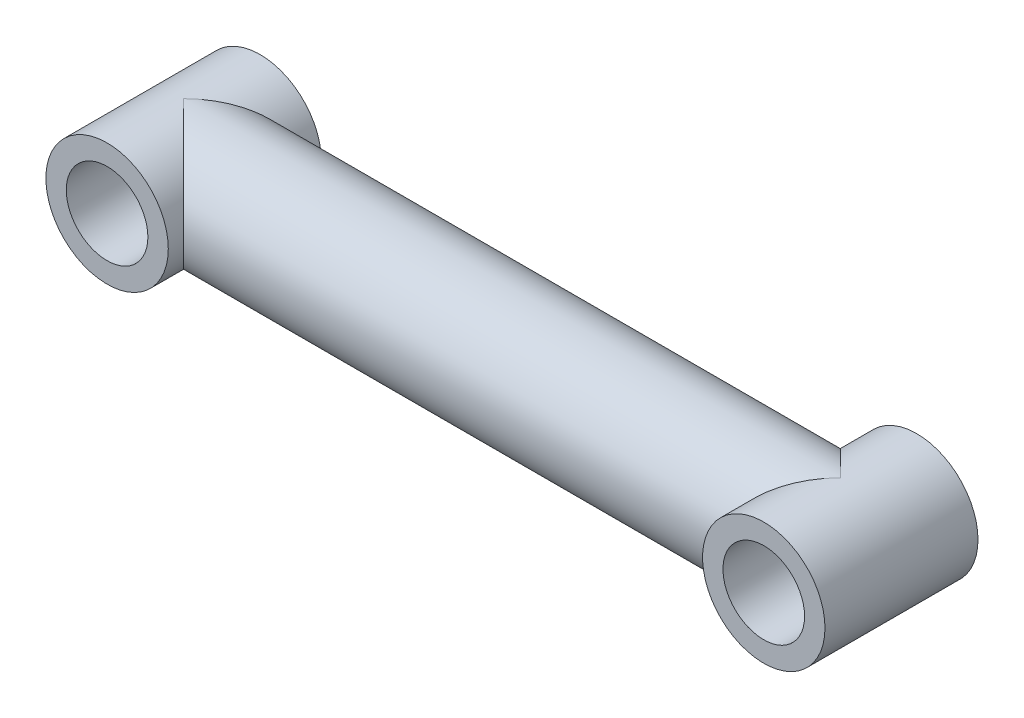
ISO-10303-21;
HEADER;
FILE_DESCRIPTION(('STEP AP214'),'2;1');
FILE_NAME('part.step','',(''),(''),'','','');
FILE_SCHEMA(('AUTOMOTIVE_DESIGN { 1 0 10303 214 1 1 1 1 }'));
ENDSEC;
DATA;
#1=APPLICATION_CONTEXT('core data for automotive mechanical design processes');
#2=APPLICATION_PROTOCOL_DEFINITION('international standard','automotive_design',2000,#1);
#3=PRODUCT_CONTEXT('',#1,'mechanical');
#4=PRODUCT('Part','Part','',(#3));
#5=PRODUCT_RELATED_PRODUCT_CATEGORY('part','',(#4));
#6=PRODUCT_DEFINITION_FORMATION('','',#4);
#7=PRODUCT_DEFINITION_CONTEXT('part definition',#1,'design');
#8=PRODUCT_DEFINITION('design','',#6,#7);
#9=PRODUCT_DEFINITION_SHAPE('','',#8);
#10=(LENGTH_UNIT() NAMED_UNIT(*) SI_UNIT(.MILLI.,.METRE.));
#11=(NAMED_UNIT(*) PLANE_ANGLE_UNIT() SI_UNIT($,.RADIAN.));
#12=(NAMED_UNIT(*) SI_UNIT($,.STERADIAN.) SOLID_ANGLE_UNIT());
#13=UNCERTAINTY_MEASURE_WITH_UNIT(LENGTH_MEASURE(1.E-05),#10,'distance_accuracy_value','');
#14=(GEOMETRIC_REPRESENTATION_CONTEXT(3) GLOBAL_UNCERTAINTY_ASSIGNED_CONTEXT((#13)) GLOBAL_UNIT_ASSIGNED_CONTEXT((#10,
#11,#12)) REPRESENTATION_CONTEXT('',''));
#15=CARTESIAN_POINT('',(0.,0.,0.));
#16=DIRECTION('',(0.,0.,1.));
#17=DIRECTION('',(1.,0.,0.));
#18=AXIS2_PLACEMENT_3D('',#15,#16,#17);
#19=CARTESIAN_POINT('',(-25.9588,0.,0.));
#20=DIRECTION('',(1.,0.,0.));
#21=DIRECTION('',(0.,0.,-1.));
#22=AXIS2_PLACEMENT_3D('',#19,#20,#21);
#23=CYLINDRICAL_SURFACE('',#22,4.8387);
#24=CARTESIAN_POINT('',(-25.9588,0.,0.));
#25=DIRECTION('',(0.707106781186547,0.,0.707106781186547));
#26=DIRECTION('',(0.707106781186547,0.,-0.707106781186547));
#27=AXIS2_PLACEMENT_3D('',#24,#25,#26);
#28=ELLIPSE('',#27,6.8429551642547,4.8387);
#29=CARTESIAN_POINT('',(-25.9588,4.8387,0.));
#30=VERTEX_POINT('',#29);
#31=CARTESIAN_POINT('',(-25.9588,-4.8387,0.));
#32=VERTEX_POINT('',#31);
#33=EDGE_CURVE('E55',#30,#32,#28,.F.);
#34=ORIENTED_EDGE('',*,*,#33,.F.);
#35=CARTESIAN_POINT('',(-25.9588,0.,0.));
#36=DIRECTION('',(0.707106781186547,0.,-0.707106781186547));
#37=DIRECTION('',(0.707106781186547,0.,0.707106781186547));
#38=AXIS2_PLACEMENT_3D('',#35,#36,#37);
#39=ELLIPSE('',#38,6.8429551642547,4.8387);
#40=EDGE_CURVE('E45',#32,#30,#39,.F.);
#41=ORIENTED_EDGE('',*,*,#40,.F.);
#42=EDGE_LOOP('',(#34,#41));
#43=FACE_BOUND('',#42,.T.);
#44=CARTESIAN_POINT('',(25.9588,0.,0.));
#45=DIRECTION('',(0.707106781186547,0.,0.707106781186547));
#46=DIRECTION('',(0.707106781186547,0.,-0.707106781186547));
#47=AXIS2_PLACEMENT_3D('',#44,#45,#46);
#48=ELLIPSE('',#47,6.8429551642547,4.8387);
#49=CARTESIAN_POINT('',(25.9588,4.8387,0.));
#50=VERTEX_POINT('',#49);
#51=CARTESIAN_POINT('',(25.9588,-4.8387,0.));
#52=VERTEX_POINT('',#51);
#53=EDGE_CURVE('E11',#50,#52,#48,.T.);
#54=ORIENTED_EDGE('',*,*,#53,.F.);
#55=CARTESIAN_POINT('',(25.9588,0.,0.));
#56=DIRECTION('',(0.707106781186547,0.,-0.707106781186547));
#57=DIRECTION('',(0.707106781186547,0.,0.707106781186547));
#58=AXIS2_PLACEMENT_3D('',#55,#56,#57);
#59=ELLIPSE('',#58,6.8429551642547,4.8387);
#60=EDGE_CURVE('E39',#52,#50,#59,.T.);
#61=ORIENTED_EDGE('',*,*,#60,.F.);
#62=EDGE_LOOP('',(#54,#61));
#63=FACE_BOUND('',#62,.T.);
#64=ADVANCED_FACE('F32',(#43,#63),#23,.T.);
#65=CARTESIAN_POINT('',(25.9588,0.,-6.04901));
#66=DIRECTION('',(0.,0.,1.));
#67=DIRECTION('',(1.,0.,0.));
#68=AXIS2_PLACEMENT_3D('',#65,#66,#67);
#69=CYLINDRICAL_SURFACE('',#68,4.8387);
#70=ORIENTED_EDGE('',*,*,#60,.T.);
#71=ORIENTED_EDGE('',*,*,#53,.T.);
#72=EDGE_LOOP('',(#70,#71));
#73=FACE_BOUND('',#72,.T.);
#74=CARTESIAN_POINT('',(25.9588,0.,-6.04901));
#75=DIRECTION('',(0.,0.,1.));
#76=DIRECTION('',(1.,0.,0.));
#77=AXIS2_PLACEMENT_3D('',#74,#75,#76);
#78=CIRCLE('',#77,4.8387);
#79=CARTESIAN_POINT('',(30.7975,0.,-6.04901));
#80=VERTEX_POINT('',#79);
#81=EDGE_CURVE('E70',#80,#80,#78,.T.);
#82=ORIENTED_EDGE('',*,*,#81,.T.);
#83=EDGE_LOOP('',(#82));
#84=FACE_BOUND('',#83,.T.);
#85=CARTESIAN_POINT('',(25.9588,0.,6.04901));
#86=DIRECTION('',(0.,0.,1.));
#87=DIRECTION('',(1.,0.,0.));
#88=AXIS2_PLACEMENT_3D('',#85,#86,#87);
#89=CIRCLE('',#88,4.8387);
#90=CARTESIAN_POINT('',(30.7975,0.,6.04901));
#91=VERTEX_POINT('',#90);
#92=EDGE_CURVE('E57',#91,#91,#89,.T.);
#93=ORIENTED_EDGE('',*,*,#92,.F.);
#94=EDGE_LOOP('',(#93));
#95=FACE_BOUND('',#94,.T.);
#96=ADVANCED_FACE('F73',(#73,#84,#95),#69,.T.);
#97=CARTESIAN_POINT('',(25.9588,0.,-6.04901));
#98=DIRECTION('',(0.,0.,1.));
#99=DIRECTION('',(1.,0.,0.));
#100=AXIS2_PLACEMENT_3D('',#97,#98,#99);
#101=PLANE('',#100);
#102=CARTESIAN_POINT('',(25.9588,0.,-6.04901));
#103=DIRECTION('',(0.,0.,1.));
#104=DIRECTION('',(1.,0.,0.));
#105=AXIS2_PLACEMENT_3D('',#102,#103,#104);
#106=CIRCLE('',#105,3.2258);
#107=CARTESIAN_POINT('',(29.1846,0.,-6.04901));
#108=VERTEX_POINT('',#107);
#109=EDGE_CURVE('E112',#108,#108,#106,.T.);
#110=ORIENTED_EDGE('',*,*,#109,.T.);
#111=EDGE_LOOP('',(#110));
#112=FACE_BOUND('',#111,.T.);
#113=ORIENTED_EDGE('',*,*,#81,.F.);
#114=EDGE_LOOP('',(#113));
#115=FACE_BOUND('',#114,.T.);
#116=ADVANCED_FACE('F79',(#112,#115),#101,.F.);
#117=CARTESIAN_POINT('',(25.9588,0.,6.04901));
#118=DIRECTION('',(0.,0.,1.));
#119=DIRECTION('',(1.,0.,0.));
#120=AXIS2_PLACEMENT_3D('',#117,#118,#119);
#121=PLANE('',#120);
#122=CARTESIAN_POINT('',(25.9588,0.,6.04901));
#123=DIRECTION('',(0.,0.,1.));
#124=DIRECTION('',(1.,0.,0.));
#125=AXIS2_PLACEMENT_3D('',#122,#123,#124);
#126=CIRCLE('',#125,3.2258);
#127=CARTESIAN_POINT('',(29.1846,0.,6.04901));
#128=VERTEX_POINT('',#127);
#129=EDGE_CURVE('E115',#128,#128,#126,.T.);
#130=ORIENTED_EDGE('',*,*,#129,.F.);
#131=EDGE_LOOP('',(#130));
#132=FACE_BOUND('',#131,.T.);
#133=ORIENTED_EDGE('',*,*,#92,.T.);
#134=EDGE_LOOP('',(#133));
#135=FACE_BOUND('',#134,.T.);
#136=ADVANCED_FACE('F83',(#132,#135),#121,.T.);
#137=CARTESIAN_POINT('',(-25.9588,0.,-6.04901));
#138=DIRECTION('',(0.,0.,1.));
#139=DIRECTION('',(1.,0.,0.));
#140=AXIS2_PLACEMENT_3D('',#137,#138,#139);
#141=CYLINDRICAL_SURFACE('',#140,4.8387);
#142=ORIENTED_EDGE('',*,*,#40,.T.);
#143=ORIENTED_EDGE('',*,*,#33,.T.);
#144=EDGE_LOOP('',(#142,#143));
#145=FACE_BOUND('',#144,.T.);
#146=CARTESIAN_POINT('',(-25.9588,0.,-6.04901));
#147=DIRECTION('',(0.,0.,1.));
#148=DIRECTION('',(1.,0.,0.));
#149=AXIS2_PLACEMENT_3D('',#146,#147,#148);
#150=CIRCLE('',#149,4.8387);
#151=CARTESIAN_POINT('',(-21.1201,0.,-6.04901));
#152=VERTEX_POINT('',#151);
#153=EDGE_CURVE('E61',#152,#152,#150,.T.);
#154=ORIENTED_EDGE('',*,*,#153,.T.);
#155=EDGE_LOOP('',(#154));
#156=FACE_BOUND('',#155,.T.);
#157=CARTESIAN_POINT('',(-25.9588,0.,6.04901));
#158=DIRECTION('',(0.,0.,1.));
#159=DIRECTION('',(1.,0.,0.));
#160=AXIS2_PLACEMENT_3D('',#157,#158,#159);
#161=CIRCLE('',#160,4.8387);
#162=CARTESIAN_POINT('',(-21.1201,0.,6.04901));
#163=VERTEX_POINT('',#162);
#164=EDGE_CURVE('E64',#163,#163,#161,.T.);
#165=ORIENTED_EDGE('',*,*,#164,.F.);
#166=EDGE_LOOP('',(#165));
#167=FACE_BOUND('',#166,.T.);
#168=ADVANCED_FACE('F59',(#145,#156,#167),#141,.T.);
#169=CARTESIAN_POINT('',(-25.9588,0.,-6.04901));
#170=DIRECTION('',(0.,0.,1.));
#171=DIRECTION('',(1.,0.,0.));
#172=AXIS2_PLACEMENT_3D('',#169,#170,#171);
#173=PLANE('',#172);
#174=CARTESIAN_POINT('',(-25.9588,0.,-6.04901));
#175=DIRECTION('',(0.,0.,1.));
#176=DIRECTION('',(1.,0.,0.));
#177=AXIS2_PLACEMENT_3D('',#174,#175,#176);
#178=CIRCLE('',#177,3.2258);
#179=CARTESIAN_POINT('',(-22.733,0.,-6.04901));
#180=VERTEX_POINT('',#179);
#181=EDGE_CURVE('E120',#180,#180,#178,.T.);
#182=ORIENTED_EDGE('',*,*,#181,.T.);
#183=EDGE_LOOP('',(#182));
#184=FACE_BOUND('',#183,.T.);
#185=ORIENTED_EDGE('',*,*,#153,.F.);
#186=EDGE_LOOP('',(#185));
#187=FACE_BOUND('',#186,.T.);
#188=ADVANCED_FACE('F92',(#184,#187),#173,.F.);
#189=CARTESIAN_POINT('',(-25.9588,0.,6.04901));
#190=DIRECTION('',(0.,0.,1.));
#191=DIRECTION('',(1.,0.,0.));
#192=AXIS2_PLACEMENT_3D('',#189,#190,#191);
#193=PLANE('',#192);
#194=CARTESIAN_POINT('',(-25.9588,0.,6.04901));
#195=DIRECTION('',(0.,0.,1.));
#196=DIRECTION('',(1.,0.,0.));
#197=AXIS2_PLACEMENT_3D('',#194,#195,#196);
#198=CIRCLE('',#197,3.2258);
#199=CARTESIAN_POINT('',(-22.733,0.,6.04901));
#200=VERTEX_POINT('',#199);
#201=EDGE_CURVE('E117',#200,#200,#198,.T.);
#202=ORIENTED_EDGE('',*,*,#201,.F.);
#203=EDGE_LOOP('',(#202));
#204=FACE_BOUND('',#203,.T.);
#205=ORIENTED_EDGE('',*,*,#164,.T.);
#206=EDGE_LOOP('',(#205));
#207=FACE_BOUND('',#206,.T.);
#208=ADVANCED_FACE('F95',(#204,#207),#193,.T.);
#209=CARTESIAN_POINT('',(-25.9588,0.,-6.04901));
#210=DIRECTION('',(0.,0.,1.));
#211=DIRECTION('',(1.,0.,0.));
#212=AXIS2_PLACEMENT_3D('',#209,#210,#211);
#213=CYLINDRICAL_SURFACE('',#212,3.2258);
#214=ORIENTED_EDGE('',*,*,#181,.F.);
#215=EDGE_LOOP('',(#214));
#216=FACE_BOUND('',#215,.T.);
#217=ORIENTED_EDGE('',*,*,#201,.T.);
#218=EDGE_LOOP('',(#217));
#219=FACE_BOUND('',#218,.T.);
#220=ADVANCED_FACE('F99',(#216,#219),#213,.F.);
#221=CARTESIAN_POINT('',(25.9588,0.,-6.04901));
#222=DIRECTION('',(0.,0.,1.));
#223=DIRECTION('',(1.,0.,0.));
#224=AXIS2_PLACEMENT_3D('',#221,#222,#223);
#225=CYLINDRICAL_SURFACE('',#224,3.2258);
#226=ORIENTED_EDGE('',*,*,#109,.F.);
#227=EDGE_LOOP('',(#226));
#228=FACE_BOUND('',#227,.T.);
#229=ORIENTED_EDGE('',*,*,#129,.T.);
#230=EDGE_LOOP('',(#229));
#231=FACE_BOUND('',#230,.T.);
#232=ADVANCED_FACE('F103',(#228,#231),#225,.F.);
#233=CLOSED_SHELL('',(#64,#96,#116,#136,#168,#188,#208,#220,#232));
#234=MANIFOLD_SOLID_BREP('B2',#233);
#235=ADVANCED_BREP_SHAPE_REPRESENTATION('',(#18,#234),#14);
#236=SHAPE_DEFINITION_REPRESENTATION(#9,#235);
ENDSEC;
END-ISO-10303-21;
